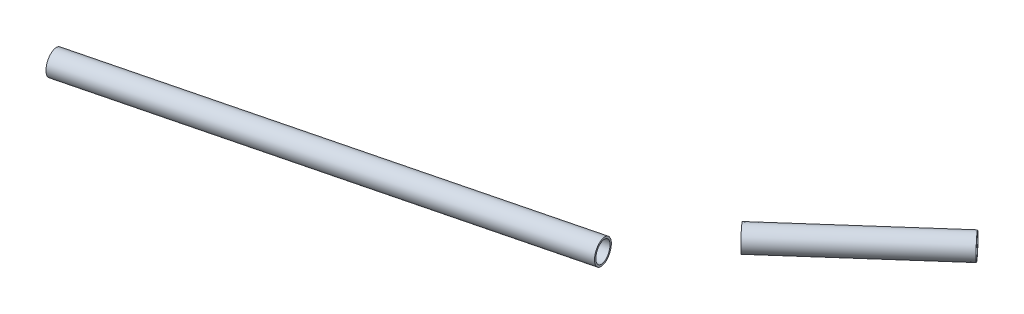
ISO-10303-21;
HEADER;
FILE_DESCRIPTION(('STEP AP214'),'2;1');
FILE_NAME('part.step','',(''),(''),'','','');
FILE_SCHEMA(('AUTOMOTIVE_DESIGN { 1 0 10303 214 1 1 1 1 }'));
ENDSEC;
DATA;
#1=APPLICATION_CONTEXT('core data for automotive mechanical design processes');
#2=APPLICATION_PROTOCOL_DEFINITION('international standard','automotive_design',2000,#1);
#3=PRODUCT_CONTEXT('',#1,'mechanical');
#4=PRODUCT('Part','Part','',(#3));
#5=PRODUCT_RELATED_PRODUCT_CATEGORY('part','',(#4));
#6=PRODUCT_DEFINITION_FORMATION('','',#4);
#7=PRODUCT_DEFINITION_CONTEXT('part definition',#1,'design');
#8=PRODUCT_DEFINITION('design','',#6,#7);
#9=PRODUCT_DEFINITION_SHAPE('','',#8);
#10=(LENGTH_UNIT() NAMED_UNIT(*) SI_UNIT(.MILLI.,.METRE.));
#11=(NAMED_UNIT(*) PLANE_ANGLE_UNIT() SI_UNIT($,.RADIAN.));
#12=(NAMED_UNIT(*) SI_UNIT($,.STERADIAN.) SOLID_ANGLE_UNIT());
#13=UNCERTAINTY_MEASURE_WITH_UNIT(LENGTH_MEASURE(1.E-05),#10,'distance_accuracy_value','');
#14=(GEOMETRIC_REPRESENTATION_CONTEXT(3) GLOBAL_UNCERTAINTY_ASSIGNED_CONTEXT((#13)) GLOBAL_UNIT_ASSIGNED_CONTEXT((#10,
#11,#12)) REPRESENTATION_CONTEXT('',''));
#15=CARTESIAN_POINT('',(0.,0.,0.));
#16=DIRECTION('',(0.,0.,1.));
#17=DIRECTION('',(1.,0.,0.));
#18=AXIS2_PLACEMENT_3D('',#15,#16,#17);
#19=CARTESIAN_POINT('',(-262.05035018698,467.999999999333,-333.273520029567));
#20=DIRECTION('',(0.748989028052665,0.,-0.662582399295909));
#21=DIRECTION('',(0.662582399295909,0.,0.748989028052665));
#22=AXIS2_PLACEMENT_3D('',#19,#20,#21);
#23=CYLINDRICAL_SURFACE('',#22,6.34999999625264);
#24=CARTESIAN_POINT('',(-180.316964724346,467.999999999333,-405.577787000219));
#25=DIRECTION('',(0.748989028052666,0.,-0.662582399295909));
#26=DIRECTION('',(-0.662582399295909,0.,-0.748989028052666));
#27=AXIS2_PLACEMENT_3D('',#24,#25,#26);
#28=CIRCLE('',#27,6.34999999625264);
#29=CARTESIAN_POINT('',(-184.524362957392,467.999999999333,-410.333867325547));
#30=VERTEX_POINT('',#29);
#31=EDGE_CURVE('E50',#30,#30,#28,.T.);
#32=ORIENTED_EDGE('',*,*,#31,.F.);
#33=EDGE_LOOP('',(#32));
#34=FACE_BOUND('',#33,.T.);
#35=CARTESIAN_POINT('',(-248.598123587351,467.999999999333,-345.173839316524));
#36=DIRECTION('',(0.748989028052666,0.,-0.662582399295909));
#37=DIRECTION('',(-0.662582399295909,0.,-0.748989028052666));
#38=AXIS2_PLACEMENT_3D('',#35,#36,#37);
#39=CIRCLE('',#38,6.34999999625264);
#40=CARTESIAN_POINT('',(-252.805521820397,467.999999999333,-349.929919641851));
#41=VERTEX_POINT('',#40);
#42=EDGE_CURVE('E11',#41,#41,#39,.T.);
#43=ORIENTED_EDGE('',*,*,#42,.T.);
#44=EDGE_LOOP('',(#43));
#45=FACE_BOUND('',#44,.T.);
#46=ADVANCED_FACE('F43',(#34,#45),#23,.T.);
#47=CARTESIAN_POINT('',(-180.316964724346,467.999999999333,-405.577787000219));
#48=DIRECTION('',(-0.748989028052666,0.,0.662582399295909));
#49=DIRECTION('',(-0.662582399295909,0.,-0.748989028052666));
#50=AXIS2_PLACEMENT_3D('',#47,#48,#49);
#51=PLANE('',#50);
#52=CARTESIAN_POINT('',(-180.316964724346,467.999999999333,-405.577787000219));
#53=DIRECTION('',(0.748989028052666,0.,-0.662582399295909));
#54=DIRECTION('',(-0.662582399295909,0.,-0.748989028052666));
#55=AXIS2_PLACEMENT_3D('',#52,#53,#54);
#56=CIRCLE('',#55,5.34999999625264);
#57=CARTESIAN_POINT('',(-183.861780558096,467.999999999333,-409.584878297494));
#58=VERTEX_POINT('',#57);
#59=EDGE_CURVE('E58',#58,#58,#56,.T.);
#60=ORIENTED_EDGE('',*,*,#59,.F.);
#61=EDGE_LOOP('',(#60));
#62=FACE_BOUND('',#61,.T.);
#63=ORIENTED_EDGE('',*,*,#31,.T.);
#64=EDGE_LOOP('',(#63));
#65=FACE_BOUND('',#64,.T.);
#66=ADVANCED_FACE('F67',(#62,#65),#51,.F.);
#67=CARTESIAN_POINT('',(-246.116949418296,462.871676598483,-342.369098002409));
#68=DIRECTION('',(-0.748989028052666,0.,0.662582399295909));
#69=DIRECTION('',(-0.390736089615029,0.807609984385931,-0.44169154552981));
#70=AXIS2_PLACEMENT_3D('',#67,#68,#69);
#71=PLANE('',#70);
#72=CARTESIAN_POINT('',(-248.598123587351,467.999999999333,-345.173839316524));
#73=DIRECTION('',(0.748989028052666,0.,-0.662582399295909));
#74=DIRECTION('',(-0.662582399295909,0.,-0.748989028052666));
#75=AXIS2_PLACEMENT_3D('',#72,#73,#74);
#76=CIRCLE('',#75,5.34999999625264);
#77=CARTESIAN_POINT('',(-252.142939421101,467.999999999333,-349.180930613799));
#78=VERTEX_POINT('',#77);
#79=EDGE_CURVE('E54',#78,#78,#76,.T.);
#80=ORIENTED_EDGE('',*,*,#79,.T.);
#81=EDGE_LOOP('',(#80));
#82=FACE_BOUND('',#81,.T.);
#83=ORIENTED_EDGE('',*,*,#42,.F.);
#84=EDGE_LOOP('',(#83));
#85=FACE_BOUND('',#84,.T.);
#86=ADVANCED_FACE('F45',(#82,#85),#71,.T.);
#87=CARTESIAN_POINT('',(-262.05035018698,467.999999999333,-333.273520029567));
#88=DIRECTION('',(0.748989028052665,0.,-0.662582399295909));
#89=DIRECTION('',(0.662582399295909,0.,0.748989028052665));
#90=AXIS2_PLACEMENT_3D('',#87,#88,#89);
#91=CYLINDRICAL_SURFACE('',#90,5.34999999625264);
#92=ORIENTED_EDGE('',*,*,#59,.T.);
#93=EDGE_LOOP('',(#92));
#94=FACE_BOUND('',#93,.T.);
#95=ORIENTED_EDGE('',*,*,#79,.F.);
#96=EDGE_LOOP('',(#95));
#97=FACE_BOUND('',#96,.T.);
#98=ADVANCED_FACE('F64',(#94,#97),#91,.F.);
#99=CLOSED_SHELL('',(#46,#66,#86,#98));
#100=MANIFOLD_SOLID_BREP('B2',#99);
#101=CARTESIAN_POINT('',(-537.221044709369,468.000000002373,-235.969292672767));
#102=DIRECTION('',(0.969786100416737,-6.66077807087855E-12,-0.24395679830351));
#103=DIRECTION('',(0.24395679830351,0.,0.969786100416737));
#104=AXIS2_PLACEMENT_3D('',#101,#102,#103);
#105=CYLINDRICAL_SURFACE('',#104,6.34999999762084);
#106=CARTESIAN_POINT('',(-280.044094419269,468.000000000607,-300.664038620634));
#107=DIRECTION('',(0.969786100416737,-6.66077807087855E-12,-0.24395679830351));
#108=DIRECTION('',(-0.24395679830351,0.,-0.969786100416737));
#109=AXIS2_PLACEMENT_3D('',#106,#107,#108);
#110=CIRCLE('',#109,6.34999999762084);
#111=CARTESIAN_POINT('',(-281.593220087916,468.000000000607,-306.822180355973));
#112=VERTEX_POINT('',#111);
#113=EDGE_CURVE('E112',#112,#112,#110,.T.);
#114=ORIENTED_EDGE('',*,*,#113,.F.);
#115=EDGE_LOOP('',(#114));
#116=FACE_BOUND('',#115,.T.);
#117=CARTESIAN_POINT('',(-519.803189587105,468.000000002253,-240.350881733608));
#118=DIRECTION('',(0.969786100416737,-6.66077753089505E-12,-0.24395679830351));
#119=DIRECTION('',(-0.24395679830351,0.,-0.969786100416737));
#120=AXIS2_PLACEMENT_3D('',#117,#118,#119);
#121=CIRCLE('',#120,6.34999999762084);
#122=CARTESIAN_POINT('',(-521.352315255752,468.000000002253,-246.509023468947));
#123=VERTEX_POINT('',#122);
#124=EDGE_CURVE('E42',#123,#123,#121,.T.);
#125=ORIENTED_EDGE('',*,*,#124,.T.);
#126=EDGE_LOOP('',(#125));
#127=FACE_BOUND('',#126,.T.);
#128=ADVANCED_FACE('F105',(#116,#127),#105,.T.);
#129=CARTESIAN_POINT('',(-280.044094419269,468.000000000607,-300.664038620634));
#130=DIRECTION('',(-0.969786100416737,6.66077807087855E-12,0.24395679830351));
#131=DIRECTION('',(-0.24395679830351,0.,-0.969786100416737));
#132=AXIS2_PLACEMENT_3D('',#129,#130,#131);
#133=PLANE('',#132);
#134=CARTESIAN_POINT('',(-280.044094419269,468.000000000607,-300.664038620634));
#135=DIRECTION('',(0.969786100416737,-6.66077807087855E-12,-0.24395679830351));
#136=DIRECTION('',(-0.24395679830351,0.,-0.969786100416737));
#137=AXIS2_PLACEMENT_3D('',#134,#135,#136);
#138=CIRCLE('',#137,5.34999999762084);
#139=CARTESIAN_POINT('',(-281.349263289613,468.000000000607,-305.852394255556));
#140=VERTEX_POINT('',#139);
#141=EDGE_CURVE('E120',#140,#140,#138,.T.);
#142=ORIENTED_EDGE('',*,*,#141,.F.);
#143=EDGE_LOOP('',(#142));
#144=FACE_BOUND('',#143,.T.);
#145=ORIENTED_EDGE('',*,*,#113,.T.);
#146=EDGE_LOOP('',(#145));
#147=FACE_BOUND('',#146,.T.);
#148=ADVANCED_FACE('F129',(#144,#147),#133,.F.);
#149=CARTESIAN_POINT('',(-519.751712357219,474.346493123876,-240.146247542898));
#150=DIRECTION('',(-0.969786100416737,6.66077753089505E-12,0.24395679830351));
#151=DIRECTION('',(-0.00810665037571744,-0.999447735688511,-0.0322258568046582));
#152=AXIS2_PLACEMENT_3D('',#149,#150,#151);
#153=PLANE('',#152);
#154=CARTESIAN_POINT('',(-519.803189587105,468.000000002253,-240.350881733608));
#155=DIRECTION('',(0.969786100416737,-6.66077753089505E-12,-0.24395679830351));
#156=DIRECTION('',(-0.24395679830351,0.,-0.969786100416737));
#157=AXIS2_PLACEMENT_3D('',#154,#155,#156);
#158=CIRCLE('',#157,5.34999999762084);
#159=CARTESIAN_POINT('',(-521.108358457448,468.000000002253,-245.53923736853));
#160=VERTEX_POINT('',#159);
#161=EDGE_CURVE('E116',#160,#160,#158,.T.);
#162=ORIENTED_EDGE('',*,*,#161,.T.);
#163=EDGE_LOOP('',(#162));
#164=FACE_BOUND('',#163,.T.);
#165=ORIENTED_EDGE('',*,*,#124,.F.);
#166=EDGE_LOOP('',(#165));
#167=FACE_BOUND('',#166,.T.);
#168=ADVANCED_FACE('F107',(#164,#167),#153,.T.);
#169=CARTESIAN_POINT('',(-537.221044709369,468.000000002373,-235.969292672767));
#170=DIRECTION('',(0.969786100416737,-6.66077807087855E-12,-0.24395679830351));
#171=DIRECTION('',(0.24395679830351,0.,0.969786100416737));
#172=AXIS2_PLACEMENT_3D('',#169,#170,#171);
#173=CYLINDRICAL_SURFACE('',#172,5.34999999762084);
#174=ORIENTED_EDGE('',*,*,#141,.T.);
#175=EDGE_LOOP('',(#174));
#176=FACE_BOUND('',#175,.T.);
#177=ORIENTED_EDGE('',*,*,#161,.F.);
#178=EDGE_LOOP('',(#177));
#179=FACE_BOUND('',#178,.T.);
#180=ADVANCED_FACE('F126',(#176,#179),#173,.F.);
#181=CLOSED_SHELL('',(#128,#148,#168,#180));
#182=MANIFOLD_SOLID_BREP('B6',#181);
#183=ADVANCED_BREP_SHAPE_REPRESENTATION('',(#18,#100,#182),#14);
#184=SHAPE_DEFINITION_REPRESENTATION(#9,#183);
ENDSEC;
END-ISO-10303-21;
